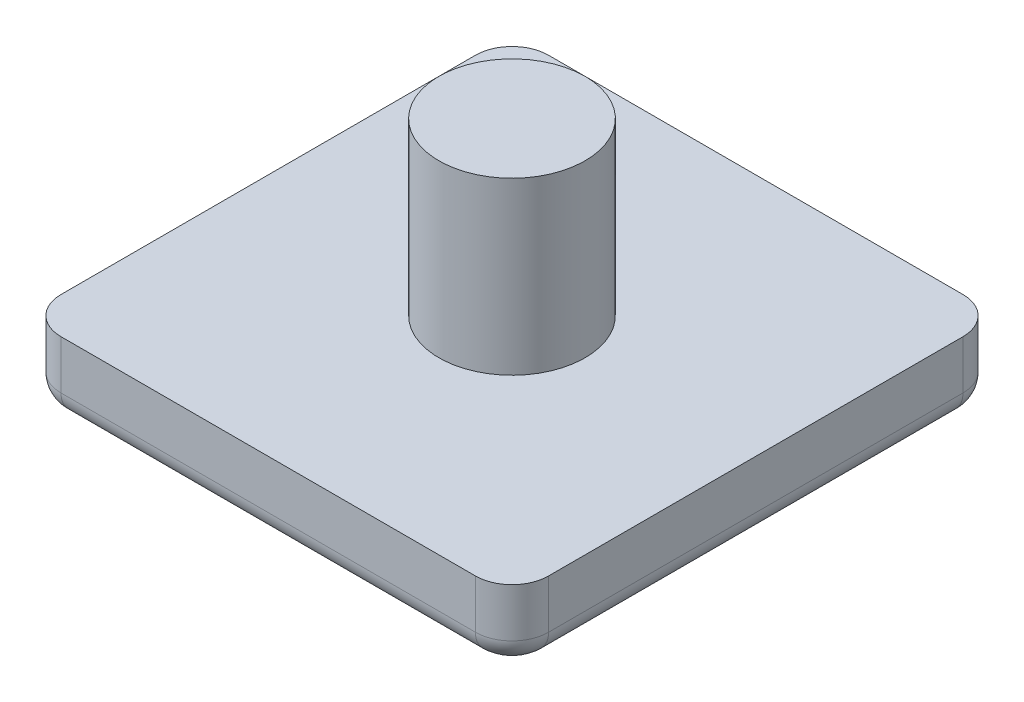
ISO-10303-21;
HEADER;
FILE_DESCRIPTION(('STEP AP214'),'2;1');
FILE_NAME('part.step','',(''),(''),'','','');
FILE_SCHEMA(('AUTOMOTIVE_DESIGN { 1 0 10303 214 1 1 1 1 }'));
ENDSEC;
DATA;
#1=APPLICATION_CONTEXT('core data for automotive mechanical design processes');
#2=APPLICATION_PROTOCOL_DEFINITION('international standard','automotive_design',2000,#1);
#3=PRODUCT_CONTEXT('',#1,'mechanical');
#4=PRODUCT('Part','Part','',(#3));
#5=PRODUCT_RELATED_PRODUCT_CATEGORY('part','',(#4));
#6=PRODUCT_DEFINITION_FORMATION('','',#4);
#7=PRODUCT_DEFINITION_CONTEXT('part definition',#1,'design');
#8=PRODUCT_DEFINITION('design','',#6,#7);
#9=PRODUCT_DEFINITION_SHAPE('','',#8);
#10=(LENGTH_UNIT() NAMED_UNIT(*) SI_UNIT(.MILLI.,.METRE.));
#11=(NAMED_UNIT(*) PLANE_ANGLE_UNIT() SI_UNIT($,.RADIAN.));
#12=(NAMED_UNIT(*) SI_UNIT($,.STERADIAN.) SOLID_ANGLE_UNIT());
#13=UNCERTAINTY_MEASURE_WITH_UNIT(LENGTH_MEASURE(1.E-05),#10,'distance_accuracy_value','');
#14=(GEOMETRIC_REPRESENTATION_CONTEXT(3) GLOBAL_UNCERTAINTY_ASSIGNED_CONTEXT((#13)) GLOBAL_UNIT_ASSIGNED_CONTEXT((#10,
#11,#12)) REPRESENTATION_CONTEXT('',''));
#15=CARTESIAN_POINT('',(0.,0.,0.));
#16=DIRECTION('',(0.,0.,1.));
#17=DIRECTION('',(1.,0.,0.));
#18=AXIS2_PLACEMENT_3D('',#15,#16,#17);
#19=CARTESIAN_POINT('',(-17.,-6.00000000000012,17.));
#20=DIRECTION('',(0.,-1.,0.));
#21=DIRECTION('',(0.,0.,-1.));
#22=AXIS2_PLACEMENT_3D('',#19,#20,#21);
#23=PLANE('',#22);
#24=CARTESIAN_POINT('',(17.,-5.99999999999988,-18.));
#25=CARTESIAN_POINT('',(17.1904756909759,-5.99999999999988,-18.));
#26=CARTESIAN_POINT('',(17.3680947095619,-5.99999999999988,-17.9297883010624));
#27=CARTESIAN_POINT('',(17.5602085598617,-5.99999999999988,-17.8538468848426));
#28=CARTESIAN_POINT('',(17.7071067811865,-5.99999999999988,-17.7071067811865));
#29=CARTESIAN_POINT('',(17.8532594110577,-5.99999999999988,-17.5611114664476));
#30=CARTESIAN_POINT('',(17.9297883010624,-5.99999999999988,-17.3680947095619));
#31=CARTESIAN_POINT('',(18.,-5.99999999999988,-17.1910108079982));
#32=CARTESIAN_POINT('',(18.,-5.99999999999988,-17.));
#33=B_SPLINE_CURVE_WITH_KNOTS('',2,(#24,#25,#26,#27,#28,#29,#30,#31,#32),.UNSPECIFIED.,.F.,.F.,
(3,2,2,2,3),(0.,0.25,0.5,0.75,1.),.UNSPECIFIED.);
#34=CARTESIAN_POINT('',(17.,-5.99999999999988,-18.));
#35=VERTEX_POINT('',#34);
#36=CARTESIAN_POINT('',(18.,-5.99999999999988,-17.));
#37=VERTEX_POINT('',#36);
#38=EDGE_CURVE('E203',#35,#37,#33,.T.);
#39=ORIENTED_EDGE('',*,*,#38,.T.);
#40=DIRECTION('',(0.,0.,-1.));
#41=VECTOR('',#40,1.);
#42=CARTESIAN_POINT('',(18.,-6.00000000000012,17.));
#43=LINE('',#42,#41);
#44=CARTESIAN_POINT('',(18.,-6.00000000000012,17.));
#45=VERTEX_POINT('',#44);
#46=EDGE_CURVE('E186',#45,#37,#43,.T.);
#47=ORIENTED_EDGE('',*,*,#46,.F.);
#48=CARTESIAN_POINT('',(18.,-6.00000000000012,17.));
#49=CARTESIAN_POINT('',(18.,-6.00000000000012,17.1904756909727));
#50=CARTESIAN_POINT('',(17.9297883010624,-6.00000000000012,17.3680947095619));
#51=CARTESIAN_POINT('',(17.8538468848449,-6.00000000000012,17.5602085598594));
#52=CARTESIAN_POINT('',(17.7071067811865,-6.00000000000013,17.7071067811865));
#53=CARTESIAN_POINT('',(17.561111466449,-6.00000000000013,17.8532594110563));
#54=CARTESIAN_POINT('',(17.3680947095619,-6.00000000000013,17.9297883010624));
#55=CARTESIAN_POINT('',(17.1910108080001,-6.00000000000013,18.));
#56=CARTESIAN_POINT('',(17.,-6.00000000000013,18.));
#57=B_SPLINE_CURVE_WITH_KNOTS('',2,(#48,#49,#50,#51,#52,#53,#54,#55,#56),.UNSPECIFIED.,.F.,.F.,
(3,2,2,2,3),(0.,0.25,0.5,0.75,1.),.UNSPECIFIED.);
#58=CARTESIAN_POINT('',(17.,-6.00000000000013,18.));
#59=VERTEX_POINT('',#58);
#60=EDGE_CURVE('E181',#45,#59,#57,.T.);
#61=ORIENTED_EDGE('',*,*,#60,.T.);
#62=DIRECTION('',(1.,0.,0.));
#63=VECTOR('',#62,1.);
#64=CARTESIAN_POINT('',(-17.,-6.00000000000013,18.));
#65=LINE('',#64,#63);
#66=CARTESIAN_POINT('',(-17.,-6.00000000000013,18.));
#67=VERTEX_POINT('',#66);
#68=EDGE_CURVE('E155',#67,#59,#65,.T.);
#69=ORIENTED_EDGE('',*,*,#68,.F.);
#70=CARTESIAN_POINT('',(-17.,-6.00000000000013,18.));
#71=CARTESIAN_POINT('',(-17.190475690972,-6.00000000000013,18.));
#72=CARTESIAN_POINT('',(-17.3680947095619,-6.00000000000013,17.9297883010624));
#73=CARTESIAN_POINT('',(-17.5602085598567,-6.00000000000013,17.8538468848462));
#74=CARTESIAN_POINT('',(-17.7071067811865,-6.00000000000013,17.7071067811865));
#75=CARTESIAN_POINT('',(-17.8532594110545,-6.00000000000012,17.5611114664522));
#76=CARTESIAN_POINT('',(-17.9297883010624,-6.00000000000012,17.3680947095619));
#77=CARTESIAN_POINT('',(-18.,-6.00000000000012,17.1910108080014));
#78=CARTESIAN_POINT('',(-18.,-6.00000000000012,17.));
#79=B_SPLINE_CURVE_WITH_KNOTS('',2,(#70,#71,#72,#73,#74,#75,#76,#77,#78),.UNSPECIFIED.,.F.,.F.,
(3,2,2,2,3),(0.,0.25,0.5,0.75,1.),.UNSPECIFIED.);
#80=CARTESIAN_POINT('',(-18.,-6.00000000000012,17.));
#81=VERTEX_POINT('',#80);
#82=EDGE_CURVE('E86',#67,#81,#79,.T.);
#83=ORIENTED_EDGE('',*,*,#82,.T.);
#84=DIRECTION('',(0.,0.,1.));
#85=VECTOR('',#84,1.);
#86=CARTESIAN_POINT('',(-18.,-6.00000000000012,17.));
#87=LINE('',#86,#85);
#88=CARTESIAN_POINT('',(-18.,-5.99999999999988,-17.));
#89=VERTEX_POINT('',#88);
#90=EDGE_CURVE('E142',#89,#81,#87,.T.);
#91=ORIENTED_EDGE('',*,*,#90,.F.);
#92=CARTESIAN_POINT('',(-18.,-5.99999999999988,-17.));
#93=CARTESIAN_POINT('',(-18.,-5.99999999999988,-17.1904756909711));
#94=CARTESIAN_POINT('',(-17.9297883010624,-5.99999999999988,-17.3680947095619));
#95=CARTESIAN_POINT('',(-17.8538468848465,-5.99999999999988,-17.5602085598571));
#96=CARTESIAN_POINT('',(-17.7071067811865,-5.99999999999988,-17.7071067811865));
#97=CARTESIAN_POINT('',(-17.5611114664488,-5.99999999999988,-17.8532594110573));
#98=CARTESIAN_POINT('',(-17.3680947095619,-5.99999999999988,-17.9297883010624));
#99=CARTESIAN_POINT('',(-17.1910108079982,-5.99999999999988,-18.));
#100=CARTESIAN_POINT('',(-17.,-5.99999999999988,-18.));
#101=B_SPLINE_CURVE_WITH_KNOTS('',2,(#92,#93,#94,#95,#96,#97,#98,#99,#100),.UNSPECIFIED.,.F.,
.F.,(3,2,2,2,3),(0.,0.25,0.5,0.75,1.),.UNSPECIFIED.);
#102=CARTESIAN_POINT('',(-17.,-5.99999999999988,-18.));
#103=VERTEX_POINT('',#102);
#104=EDGE_CURVE('E208',#89,#103,#101,.T.);
#105=ORIENTED_EDGE('',*,*,#104,.T.);
#106=DIRECTION('',(-1.,0.,0.));
#107=VECTOR('',#106,1.);
#108=CARTESIAN_POINT('',(-17.,-5.99999999999988,-18.));
#109=LINE('',#108,#107);
#110=EDGE_CURVE('E207',#35,#103,#109,.T.);
#111=ORIENTED_EDGE('',*,*,#110,.F.);
#112=EDGE_LOOP('',(#39,#47,#61,#69,#83,#91,#105,#111));
#113=FACE_BOUND('',#112,.T.);
#114=ADVANCED_FACE('F17',(#113),#23,.T.);
#115=CARTESIAN_POINT('',(-18.,-4.00000000000012,17.));
#116=DIRECTION('',(0.,0.,1.));
#117=DIRECTION('',(0.,-1.,0.));
#118=AXIS2_PLACEMENT_3D('',#115,#116,#117);
#119=CYLINDRICAL_SURFACE('',#118,2.);
#120=CARTESIAN_POINT('',(-18.,-4.00000000000012,17.));
#121=DIRECTION('',(0.,0.,-1.));
#122=DIRECTION('',(-1.,0.,0.));
#123=AXIS2_PLACEMENT_3D('',#120,#121,#122);
#124=CIRCLE('',#123,2.);
#125=CARTESIAN_POINT('',(-20.,-4.00000000000012,17.));
#126=VERTEX_POINT('',#125);
#127=EDGE_CURVE('E133',#81,#126,#124,.T.);
#128=ORIENTED_EDGE('',*,*,#127,.T.);
#129=DIRECTION('',(0.,0.,-1.));
#130=VECTOR('',#129,1.);
#131=CARTESIAN_POINT('',(-20.,-4.00000000000012,17.));
#132=LINE('',#131,#130);
#133=CARTESIAN_POINT('',(-20.,-3.99999999999994,-17.));
#134=VERTEX_POINT('',#133);
#135=EDGE_CURVE('E124',#126,#134,#132,.T.);
#136=ORIENTED_EDGE('',*,*,#135,.T.);
#137=CARTESIAN_POINT('',(-18.,-3.99999999999988,-17.));
#138=DIRECTION('',(0.,0.,1.));
#139=DIRECTION('',(1.,0.,0.));
#140=AXIS2_PLACEMENT_3D('',#137,#138,#139);
#141=CIRCLE('',#140,2.);
#142=EDGE_CURVE('E96',#134,#89,#141,.T.);
#143=ORIENTED_EDGE('',*,*,#142,.T.);
#144=ORIENTED_EDGE('',*,*,#90,.T.);
#145=EDGE_LOOP('',(#128,#136,#143,#144));
#146=FACE_BOUND('',#145,.T.);
#147=ADVANCED_FACE('F141',(#146),#119,.T.);
#148=CARTESIAN_POINT('',(-17.,-3.99999999999988,-17.));
#149=DIRECTION('',(0.,-1.,0.));
#150=DIRECTION('',(0.,0.,-1.));
#151=AXIS2_PLACEMENT_3D('',#148,#149,#150);
#152=DEGENERATE_TOROIDAL_SURFACE('',#151,1.,2.,.T.);
#153=ORIENTED_EDGE('',*,*,#104,.F.);
#154=ORIENTED_EDGE('',*,*,#142,.F.);
#155=CARTESIAN_POINT('',(-17.,-3.99999999999988,-17.));
#156=DIRECTION('',(0.,1.,0.));
#157=DIRECTION('',(0.,0.,1.));
#158=AXIS2_PLACEMENT_3D('',#155,#156,#157);
#159=CIRCLE('',#158,3.);
#160=CARTESIAN_POINT('',(-17.,-3.99999999999986,-20.));
#161=VERTEX_POINT('',#160);
#162=EDGE_CURVE('E132',#161,#134,#159,.T.);
#163=ORIENTED_EDGE('',*,*,#162,.F.);
#164=CARTESIAN_POINT('',(-17.,-3.99999999999988,-18.));
#165=DIRECTION('',(-1.,0.,0.));
#166=DIRECTION('',(0.,0.,1.));
#167=AXIS2_PLACEMENT_3D('',#164,#165,#166);
#168=CIRCLE('',#167,2.);
#169=EDGE_CURVE('E104',#103,#161,#168,.F.);
#170=ORIENTED_EDGE('',*,*,#169,.F.);
#171=EDGE_LOOP('',(#153,#154,#163,#170));
#172=FACE_BOUND('',#171,.T.);
#173=ADVANCED_FACE('F235',(#172),#152,.T.);
#174=CARTESIAN_POINT('',(-17.,-3.99999999999988,-18.));
#175=DIRECTION('',(-1.,0.,0.));
#176=DIRECTION('',(0.,0.,1.));
#177=AXIS2_PLACEMENT_3D('',#174,#175,#176);
#178=CYLINDRICAL_SURFACE('',#177,2.);
#179=CARTESIAN_POINT('',(17.,-3.99999999999986,-18.));
#180=DIRECTION('',(-1.,0.,0.));
#181=DIRECTION('',(0.,0.,1.));
#182=AXIS2_PLACEMENT_3D('',#179,#180,#181);
#183=CIRCLE('',#182,2.00000000000002);
#184=CARTESIAN_POINT('',(17.,-3.99999999999986,-20.));
#185=VERTEX_POINT('',#184);
#186=EDGE_CURVE('E187',#185,#35,#183,.T.);
#187=ORIENTED_EDGE('',*,*,#186,.T.);
#188=ORIENTED_EDGE('',*,*,#110,.T.);
#189=ORIENTED_EDGE('',*,*,#169,.T.);
#190=DIRECTION('',(1.,0.,0.));
#191=VECTOR('',#190,1.);
#192=CARTESIAN_POINT('',(-17.,-3.99999999999986,-20.));
#193=LINE('',#192,#191);
#194=EDGE_CURVE('E194',#161,#185,#193,.T.);
#195=ORIENTED_EDGE('',*,*,#194,.T.);
#196=EDGE_LOOP('',(#187,#188,#189,#195));
#197=FACE_BOUND('',#196,.T.);
#198=ADVANCED_FACE('F332',(#197),#178,.T.);
#199=CARTESIAN_POINT('',(17.,-3.99999999999987,-17.));
#200=DIRECTION('',(0.,-1.,0.));
#201=DIRECTION('',(0.,0.,-1.));
#202=AXIS2_PLACEMENT_3D('',#199,#200,#201);
#203=DEGENERATE_TOROIDAL_SURFACE('',#202,0.99999999999998,2.00000000000002,.T.);
#204=CARTESIAN_POINT('',(17.,-3.99999999999988,-17.));
#205=DIRECTION('',(0.,1.,0.));
#206=DIRECTION('',(0.,0.,1.));
#207=AXIS2_PLACEMENT_3D('',#204,#205,#206);
#208=CIRCLE('',#207,3.);
#209=CARTESIAN_POINT('',(20.,-3.99999999999988,-17.));
#210=VERTEX_POINT('',#209);
#211=EDGE_CURVE('E190',#210,#185,#208,.T.);
#212=ORIENTED_EDGE('',*,*,#211,.F.);
#213=CARTESIAN_POINT('',(18.,-3.99999999999988,-17.));
#214=DIRECTION('',(0.,0.,-1.));
#215=DIRECTION('',(0.,1.,0.));
#216=AXIS2_PLACEMENT_3D('',#213,#214,#215);
#217=CIRCLE('',#216,2.);
#218=EDGE_CURVE('E184',#37,#210,#217,.F.);
#219=ORIENTED_EDGE('',*,*,#218,.F.);
#220=ORIENTED_EDGE('',*,*,#38,.F.);
#221=ORIENTED_EDGE('',*,*,#186,.F.);
#222=EDGE_LOOP('',(#212,#219,#220,#221));
#223=FACE_BOUND('',#222,.T.);
#224=ADVANCED_FACE('F334',(#223),#203,.T.);
#225=CARTESIAN_POINT('',(18.,-4.00000000000012,17.));
#226=DIRECTION('',(0.,0.,-1.));
#227=DIRECTION('',(0.,1.,0.));
#228=AXIS2_PLACEMENT_3D('',#225,#226,#227);
#229=CYLINDRICAL_SURFACE('',#228,2.);
#230=CARTESIAN_POINT('',(18.,-4.00000000000012,17.));
#231=DIRECTION('',(0.,0.,-1.));
#232=DIRECTION('',(-1.,0.,0.));
#233=AXIS2_PLACEMENT_3D('',#230,#231,#232);
#234=CIRCLE('',#233,2.);
#235=CARTESIAN_POINT('',(20.,-4.00000000000006,17.));
#236=VERTEX_POINT('',#235);
#237=EDGE_CURVE('E164',#236,#45,#234,.T.);
#238=ORIENTED_EDGE('',*,*,#237,.T.);
#239=ORIENTED_EDGE('',*,*,#46,.T.);
#240=ORIENTED_EDGE('',*,*,#218,.T.);
#241=DIRECTION('',(0.,0.,1.));
#242=VECTOR('',#241,1.);
#243=CARTESIAN_POINT('',(20.,-3.99999999999988,-17.));
#244=LINE('',#243,#242);
#245=EDGE_CURVE('E171',#210,#236,#244,.T.);
#246=ORIENTED_EDGE('',*,*,#245,.T.);
#247=EDGE_LOOP('',(#238,#239,#240,#246));
#248=FACE_BOUND('',#247,.T.);
#249=ADVANCED_FACE('F338',(#248),#229,.T.);
#250=CARTESIAN_POINT('',(17.,-4.00000000000012,17.));
#251=DIRECTION('',(0.,-1.,0.));
#252=DIRECTION('',(0.,0.,-1.));
#253=AXIS2_PLACEMENT_3D('',#250,#251,#252);
#254=DEGENERATE_TOROIDAL_SURFACE('',#253,1.,2.,.T.);
#255=CARTESIAN_POINT('',(17.,-4.00000000000012,17.));
#256=DIRECTION('',(0.,1.,0.));
#257=DIRECTION('',(0.,0.,1.));
#258=AXIS2_PLACEMENT_3D('',#255,#256,#257);
#259=CIRCLE('',#258,3.);
#260=CARTESIAN_POINT('',(17.,-4.00000000000014,20.));
#261=VERTEX_POINT('',#260);
#262=EDGE_CURVE('E167',#261,#236,#259,.T.);
#263=ORIENTED_EDGE('',*,*,#262,.F.);
#264=CARTESIAN_POINT('',(17.,-4.00000000000013,18.));
#265=DIRECTION('',(1.,0.,0.));
#266=DIRECTION('',(0.,0.,-1.));
#267=AXIS2_PLACEMENT_3D('',#264,#265,#266);
#268=CIRCLE('',#267,2.);
#269=EDGE_CURVE('E162',#59,#261,#268,.F.);
#270=ORIENTED_EDGE('',*,*,#269,.F.);
#271=ORIENTED_EDGE('',*,*,#60,.F.);
#272=ORIENTED_EDGE('',*,*,#237,.F.);
#273=EDGE_LOOP('',(#263,#270,#271,#272));
#274=FACE_BOUND('',#273,.T.);
#275=ADVANCED_FACE('F340',(#274),#254,.T.);
#276=CARTESIAN_POINT('',(-17.,-4.00000000000013,18.));
#277=DIRECTION('',(1.,0.,0.));
#278=DIRECTION('',(0.,0.,-1.));
#279=AXIS2_PLACEMENT_3D('',#276,#277,#278);
#280=CYLINDRICAL_SURFACE('',#279,2.);
#281=CARTESIAN_POINT('',(-17.,-4.00000000000014,18.));
#282=DIRECTION('',(1.,0.,0.));
#283=DIRECTION('',(0.,0.,-1.));
#284=AXIS2_PLACEMENT_3D('',#281,#282,#283);
#285=CIRCLE('',#284,1.99999999999999);
#286=CARTESIAN_POINT('',(-17.,-4.00000000000014,20.));
#287=VERTEX_POINT('',#286);
#288=EDGE_CURVE('E143',#287,#67,#285,.T.);
#289=ORIENTED_EDGE('',*,*,#288,.T.);
#290=ORIENTED_EDGE('',*,*,#68,.T.);
#291=ORIENTED_EDGE('',*,*,#269,.T.);
#292=DIRECTION('',(1.,0.,0.));
#293=VECTOR('',#292,1.);
#294=CARTESIAN_POINT('',(17.,-4.00000000000014,20.));
#295=LINE('',#294,#293);
#296=EDGE_CURVE('E139',#261,#287,#295,.F.);
#297=ORIENTED_EDGE('',*,*,#296,.T.);
#298=EDGE_LOOP('',(#289,#290,#291,#297));
#299=FACE_BOUND('',#298,.T.);
#300=ADVANCED_FACE('F304',(#299),#280,.T.);
#301=CARTESIAN_POINT('',(-17.,-4.00000000000013,17.));
#302=DIRECTION('',(0.,-1.,0.));
#303=DIRECTION('',(0.,0.,-1.));
#304=AXIS2_PLACEMENT_3D('',#301,#302,#303);
#305=DEGENERATE_TOROIDAL_SURFACE('',#304,1.00000000000001,1.99999999999999,.T.);
#306=ORIENTED_EDGE('',*,*,#82,.F.);
#307=ORIENTED_EDGE('',*,*,#288,.F.);
#308=CARTESIAN_POINT('',(-17.,-4.00000000000012,17.));
#309=DIRECTION('',(0.,1.,0.));
#310=DIRECTION('',(0.,0.,1.));
#311=AXIS2_PLACEMENT_3D('',#308,#309,#310);
#312=CIRCLE('',#311,3.);
#313=EDGE_CURVE('E137',#126,#287,#312,.T.);
#314=ORIENTED_EDGE('',*,*,#313,.F.);
#315=ORIENTED_EDGE('',*,*,#127,.F.);
#316=EDGE_LOOP('',(#306,#307,#314,#315));
#317=FACE_BOUND('',#316,.T.);
#318=ADVANCED_FACE('F19',(#317),#305,.T.);
#319=CARTESIAN_POINT('',(0.,14.,1.25340818453445E-13));
#320=DIRECTION('',(0.,-1.,0.));
#321=DIRECTION('',(0.,0.,-1.));
#322=AXIS2_PLACEMENT_3D('',#319,#320,#321);
#323=PLANE('',#322);
#324=CARTESIAN_POINT('',(0.,14.,1.25340818453445E-13));
#325=DIRECTION('',(0.,-1.,0.));
#326=DIRECTION('',(0.,0.,-1.));
#327=AXIS2_PLACEMENT_3D('',#324,#325,#326);
#328=CIRCLE('',#327,6.);
#329=CARTESIAN_POINT('',(0.,14.,-5.99999999999987));
#330=VERTEX_POINT('',#329);
#331=EDGE_CURVE('E21',#330,#330,#328,.T.);
#332=ORIENTED_EDGE('',*,*,#331,.F.);
#333=EDGE_LOOP('',(#332));
#334=FACE_BOUND('',#333,.T.);
#335=ADVANCED_FACE('F429',(#334),#323,.F.);
#336=CARTESIAN_POINT('',(-20.,-6.00000000000012,17.));
#337=DIRECTION('',(1.,0.,0.));
#338=DIRECTION('',(0.,0.,-1.));
#339=AXIS2_PLACEMENT_3D('',#336,#337,#338);
#340=PLANE('',#339);
#341=ORIENTED_EDGE('',*,*,#135,.F.);
#342=DIRECTION('',(0.,1.,0.));
#343=VECTOR('',#342,1.);
#344=CARTESIAN_POINT('',(-20.,-6.00000000000012,17.));
#345=LINE('',#344,#343);
#346=CARTESIAN_POINT('',(-20.,-1.18828558104411E-13,17.));
#347=VERTEX_POINT('',#346);
#348=EDGE_CURVE('E128',#347,#126,#345,.F.);
#349=ORIENTED_EDGE('',*,*,#348,.F.);
#350=DIRECTION('',(0.,0.,-1.));
#351=VECTOR('',#350,1.);
#352=CARTESIAN_POINT('',(-20.,-1.17961196366423E-13,17.));
#353=LINE('',#352,#351);
#354=CARTESIAN_POINT('',(-20.,1.18769496191065E-13,-17.));
#355=VERTEX_POINT('',#354);
#356=EDGE_CURVE('E268',#347,#355,#353,.T.);
#357=ORIENTED_EDGE('',*,*,#356,.T.);
#358=DIRECTION('',(0.,1.,0.));
#359=VECTOR('',#358,1.);
#360=CARTESIAN_POINT('',(-20.,-5.99999999999988,-17.));
#361=LINE('',#360,#359);
#362=EDGE_CURVE('E129',#134,#355,#361,.T.);
#363=ORIENTED_EDGE('',*,*,#362,.F.);
#364=EDGE_LOOP('',(#341,#349,#357,#363));
#365=FACE_BOUND('',#364,.T.);
#366=ADVANCED_FACE('F126',(#365),#340,.F.);
#367=CARTESIAN_POINT('',(-17.,-5.99999999999988,-17.));
#368=DIRECTION('',(0.,1.,0.));
#369=DIRECTION('',(0.,0.,1.));
#370=AXIS2_PLACEMENT_3D('',#367,#368,#369);
#371=CYLINDRICAL_SURFACE('',#370,3.);
#372=ORIENTED_EDGE('',*,*,#362,.T.);
#373=CARTESIAN_POINT('',(-17.,1.17961196366423E-13,-17.));
#374=DIRECTION('',(0.,1.,0.));
#375=DIRECTION('',(0.,0.,1.));
#376=AXIS2_PLACEMENT_3D('',#373,#374,#375);
#377=CIRCLE('',#376,3.);
#378=CARTESIAN_POINT('',(-17.,1.38843987305612E-13,-20.));
#379=VERTEX_POINT('',#378);
#380=EDGE_CURVE('E266',#355,#379,#377,.F.);
#381=ORIENTED_EDGE('',*,*,#380,.T.);
#382=DIRECTION('',(0.,-1.,0.));
#383=VECTOR('',#382,1.);
#384=CARTESIAN_POINT('',(-17.,-5.99999999999986,-20.));
#385=LINE('',#384,#383);
#386=EDGE_CURVE('E198',#379,#161,#385,.T.);
#387=ORIENTED_EDGE('',*,*,#386,.T.);
#388=ORIENTED_EDGE('',*,*,#162,.T.);
#389=EDGE_LOOP('',(#372,#381,#387,#388));
#390=FACE_BOUND('',#389,.T.);
#391=ADVANCED_FACE('F330',(#390),#371,.T.);
#392=CARTESIAN_POINT('',(-17.,-5.99999999999986,-20.));
#393=DIRECTION('',(0.,0.,1.));
#394=DIRECTION('',(0.,-1.,0.));
#395=AXIS2_PLACEMENT_3D('',#392,#393,#394);
#396=PLANE('',#395);
#397=ORIENTED_EDGE('',*,*,#194,.F.);
#398=ORIENTED_EDGE('',*,*,#386,.F.);
#399=DIRECTION('',(1.,0.,0.));
#400=VECTOR('',#399,1.);
#401=CARTESIAN_POINT('',(-17.,1.40408572355671E-13,-20.));
#402=LINE('',#401,#400);
#403=CARTESIAN_POINT('',(17.,1.40578710781589E-13,-20.));
#404=VERTEX_POINT('',#403);
#405=EDGE_CURVE('E265',#379,#404,#402,.T.);
#406=ORIENTED_EDGE('',*,*,#405,.T.);
#407=DIRECTION('',(0.,1.,0.));
#408=VECTOR('',#407,1.);
#409=CARTESIAN_POINT('',(17.,-5.99999999999986,-20.));
#410=LINE('',#409,#408);
#411=EDGE_CURVE('E193',#185,#404,#410,.T.);
#412=ORIENTED_EDGE('',*,*,#411,.F.);
#413=EDGE_LOOP('',(#397,#398,#406,#412));
#414=FACE_BOUND('',#413,.T.);
#415=ADVANCED_FACE('F329',(#414),#396,.F.);
#416=CARTESIAN_POINT('',(17.,-5.99999999999988,-17.));
#417=DIRECTION('',(0.,1.,0.));
#418=DIRECTION('',(0.,0.,1.));
#419=AXIS2_PLACEMENT_3D('',#416,#417,#418);
#420=CYLINDRICAL_SURFACE('',#419,3.);
#421=ORIENTED_EDGE('',*,*,#411,.T.);
#422=CARTESIAN_POINT('',(17.,1.196959198424E-13,-17.));
#423=DIRECTION('',(0.,1.,0.));
#424=DIRECTION('',(0.,0.,1.));
#425=AXIS2_PLACEMENT_3D('',#422,#423,#424);
#426=CIRCLE('',#425,3.);
#427=CARTESIAN_POINT('',(20.,1.196959198424E-13,-17.));
#428=VERTEX_POINT('',#427);
#429=EDGE_CURVE('E263',#404,#428,#426,.F.);
#430=ORIENTED_EDGE('',*,*,#429,.T.);
#431=DIRECTION('',(0.,1.,0.));
#432=VECTOR('',#431,1.);
#433=CARTESIAN_POINT('',(20.,-5.99999999999988,-17.));
#434=LINE('',#433,#432);
#435=EDGE_CURVE('E176',#428,#210,#434,.F.);
#436=ORIENTED_EDGE('',*,*,#435,.T.);
#437=ORIENTED_EDGE('',*,*,#211,.T.);
#438=EDGE_LOOP('',(#421,#430,#436,#437));
#439=FACE_BOUND('',#438,.T.);
#440=ADVANCED_FACE('F324',(#439),#420,.T.);
#441=CARTESIAN_POINT('',(20.,-5.99999999999988,-17.));
#442=DIRECTION('',(-1.,0.,0.));
#443=DIRECTION('',(0.,0.,1.));
#444=AXIS2_PLACEMENT_3D('',#441,#442,#443);
#445=PLANE('',#444);
#446=ORIENTED_EDGE('',*,*,#245,.F.);
#447=ORIENTED_EDGE('',*,*,#435,.F.);
#448=DIRECTION('',(0.,0.,-1.));
#449=VECTOR('',#448,1.);
#450=CARTESIAN_POINT('',(20.,-1.17961196366423E-13,17.));
#451=LINE('',#450,#449);
#452=CARTESIAN_POINT('',(20.,-1.17961196366423E-13,17.));
#453=VERTEX_POINT('',#452);
#454=EDGE_CURVE('E262',#428,#453,#451,.F.);
#455=ORIENTED_EDGE('',*,*,#454,.T.);
#456=DIRECTION('',(0.,1.,0.));
#457=VECTOR('',#456,1.);
#458=CARTESIAN_POINT('',(20.,-6.00000000000012,17.));
#459=LINE('',#458,#457);
#460=EDGE_CURVE('E170',#236,#453,#459,.T.);
#461=ORIENTED_EDGE('',*,*,#460,.F.);
#462=EDGE_LOOP('',(#446,#447,#455,#461));
#463=FACE_BOUND('',#462,.T.);
#464=ADVANCED_FACE('F319',(#463),#445,.F.);
#465=CARTESIAN_POINT('',(17.,-6.00000000000012,17.));
#466=DIRECTION('',(0.,1.,0.));
#467=DIRECTION('',(0.,0.,1.));
#468=AXIS2_PLACEMENT_3D('',#465,#466,#467);
#469=CYLINDRICAL_SURFACE('',#468,3.);
#470=ORIENTED_EDGE('',*,*,#460,.T.);
#471=CARTESIAN_POINT('',(17.,-1.17961196366423E-13,17.));
#472=DIRECTION('',(0.,1.,0.));
#473=DIRECTION('',(0.,0.,1.));
#474=AXIS2_PLACEMENT_3D('',#471,#472,#473);
#475=CIRCLE('',#474,3.);
#476=CARTESIAN_POINT('',(17.,-1.38843987305612E-13,20.));
#477=VERTEX_POINT('',#476);
#478=EDGE_CURVE('E259',#453,#477,#475,.F.);
#479=ORIENTED_EDGE('',*,*,#478,.T.);
#480=DIRECTION('',(0.,1.,0.));
#481=VECTOR('',#480,1.);
#482=CARTESIAN_POINT('',(17.,-6.00000000000014,20.));
#483=LINE('',#482,#481);
#484=EDGE_CURVE('E282',#477,#261,#483,.F.);
#485=ORIENTED_EDGE('',*,*,#484,.T.);
#486=ORIENTED_EDGE('',*,*,#262,.T.);
#487=EDGE_LOOP('',(#470,#479,#485,#486));
#488=FACE_BOUND('',#487,.T.);
#489=ADVANCED_FACE('F342',(#488),#469,.T.);
#490=CARTESIAN_POINT('',(17.,-6.00000000000014,20.));
#491=DIRECTION('',(0.,0.,-1.));
#492=DIRECTION('',(0.,1.,0.));
#493=AXIS2_PLACEMENT_3D('',#490,#491,#492);
#494=PLANE('',#493);
#495=ORIENTED_EDGE('',*,*,#296,.F.);
#496=ORIENTED_EDGE('',*,*,#484,.F.);
#497=DIRECTION('',(1.,0.,0.));
#498=VECTOR('',#497,1.);
#499=CARTESIAN_POINT('',(-17.,-1.38910096533079E-13,20.));
#500=LINE('',#499,#498);
#501=CARTESIAN_POINT('',(-17.,-1.40578710781589E-13,20.));
#502=VERTEX_POINT('',#501);
#503=EDGE_CURVE('E258',#477,#502,#500,.F.);
#504=ORIENTED_EDGE('',*,*,#503,.T.);
#505=DIRECTION('',(0.,1.,0.));
#506=VECTOR('',#505,1.);
#507=CARTESIAN_POINT('',(-17.,-6.00000000000014,20.));
#508=LINE('',#507,#506);
#509=EDGE_CURVE('E36',#287,#502,#508,.T.);
#510=ORIENTED_EDGE('',*,*,#509,.F.);
#511=EDGE_LOOP('',(#495,#496,#504,#510));
#512=FACE_BOUND('',#511,.T.);
#513=ADVANCED_FACE('F309',(#512),#494,.F.);
#514=CARTESIAN_POINT('',(-17.,-6.00000000000012,17.));
#515=DIRECTION('',(0.,1.,0.));
#516=DIRECTION('',(0.,0.,1.));
#517=AXIS2_PLACEMENT_3D('',#514,#515,#516);
#518=CYLINDRICAL_SURFACE('',#517,3.);
#519=ORIENTED_EDGE('',*,*,#509,.T.);
#520=CARTESIAN_POINT('',(-17.,-1.196959198424E-13,17.));
#521=DIRECTION('',(0.,1.,0.));
#522=DIRECTION('',(0.,0.,1.));
#523=AXIS2_PLACEMENT_3D('',#520,#521,#522);
#524=CIRCLE('',#523,3.);
#525=EDGE_CURVE('E27',#502,#347,#524,.F.);
#526=ORIENTED_EDGE('',*,*,#525,.T.);
#527=ORIENTED_EDGE('',*,*,#348,.T.);
#528=ORIENTED_EDGE('',*,*,#313,.T.);
#529=EDGE_LOOP('',(#519,#526,#527,#528));
#530=FACE_BOUND('',#529,.T.);
#531=ADVANCED_FACE('F135',(#530),#518,.T.);
#532=CARTESIAN_POINT('',(0.,14.,1.25340818453445E-13));
#533=DIRECTION('',(0.,-1.,0.));
#534=DIRECTION('',(0.,0.,-1.));
#535=AXIS2_PLACEMENT_3D('',#532,#533,#534);
#536=CYLINDRICAL_SURFACE('',#535,6.);
#537=CARTESIAN_POINT('',(0.,0.,0.));
#538=DIRECTION('',(0.,-1.,0.));
#539=DIRECTION('',(0.,0.,-1.));
#540=AXIS2_PLACEMENT_3D('',#537,#538,#539);
#541=CIRCLE('',#540,6.);
#542=CARTESIAN_POINT('',(0.,0.,-5.99999999999997));
#543=VERTEX_POINT('',#542);
#544=EDGE_CURVE('E11',#543,#543,#541,.F.);
#545=ORIENTED_EDGE('',*,*,#544,.T.);
#546=EDGE_LOOP('',(#545));
#547=FACE_BOUND('',#546,.T.);
#548=ORIENTED_EDGE('',*,*,#331,.T.);
#549=EDGE_LOOP('',(#548));
#550=FACE_BOUND('',#549,.T.);
#551=ADVANCED_FACE('F353',(#547,#550),#536,.T.);
#552=CARTESIAN_POINT('',(-17.,-1.17961196366423E-13,17.));
#553=DIRECTION('',(0.,-1.,0.));
#554=DIRECTION('',(0.,0.,-1.));
#555=AXIS2_PLACEMENT_3D('',#552,#553,#554);
#556=PLANE('',#555);
#557=ORIENTED_EDGE('',*,*,#544,.F.);
#558=EDGE_LOOP('',(#557));
#559=FACE_BOUND('',#558,.T.);
#560=ORIENTED_EDGE('',*,*,#503,.F.);
#561=ORIENTED_EDGE('',*,*,#478,.F.);
#562=ORIENTED_EDGE('',*,*,#454,.F.);
#563=ORIENTED_EDGE('',*,*,#429,.F.);
#564=ORIENTED_EDGE('',*,*,#405,.F.);
#565=ORIENTED_EDGE('',*,*,#380,.F.);
#566=ORIENTED_EDGE('',*,*,#356,.F.);
#567=ORIENTED_EDGE('',*,*,#525,.F.);
#568=EDGE_LOOP('',(#560,#561,#562,#563,#564,#565,#566,#567));
#569=FACE_BOUND('',#568,.T.);
#570=ADVANCED_FACE('F321',(#559,#569),#556,.F.);
#571=CLOSED_SHELL('',(#114,#147,#173,#198,#224,#249,#275,#300,#318,#335,#366,#391,#415,#440,
#464,#489,#513,#531,#551,#570));
#572=MANIFOLD_SOLID_BREP('B1',#571);
#573=ADVANCED_BREP_SHAPE_REPRESENTATION('',(#18,#572),#14);
#574=SHAPE_DEFINITION_REPRESENTATION(#9,#573);
ENDSEC;
END-ISO-10303-21;
